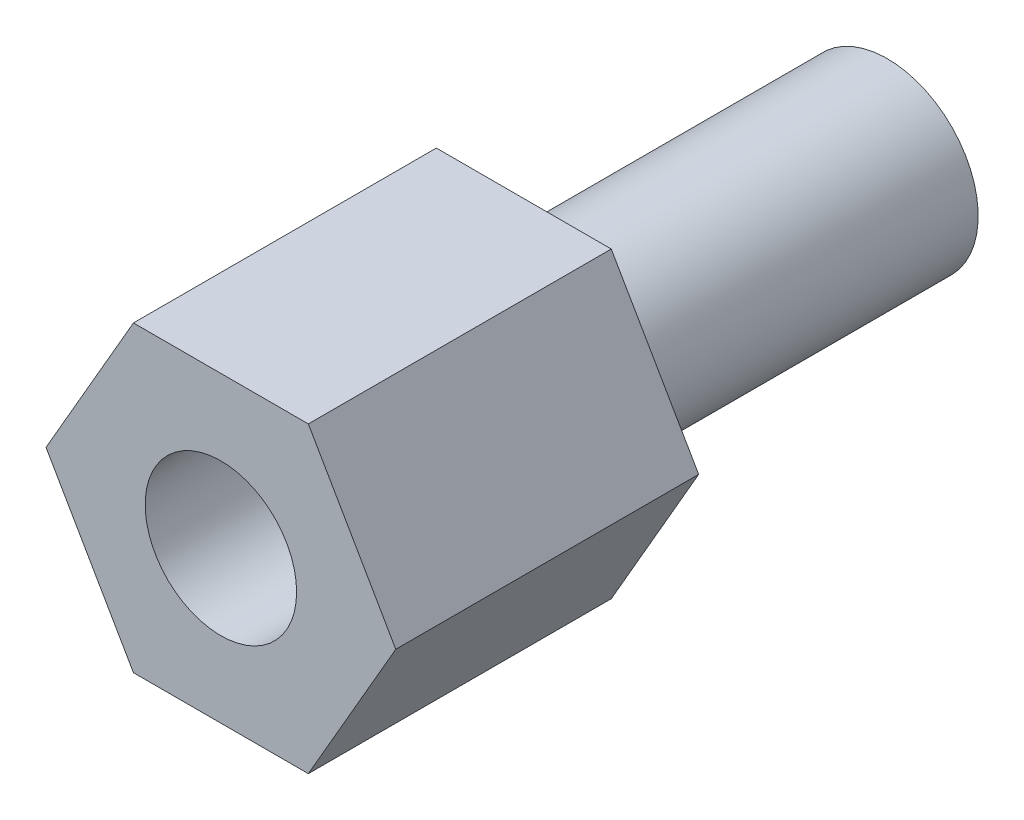
ISO-10303-21;
HEADER;
FILE_DESCRIPTION(('STEP AP214'),'2;1');
FILE_NAME('part.step','',(''),(''),'','','');
FILE_SCHEMA(('AUTOMOTIVE_DESIGN { 1 0 10303 214 1 1 1 1 }'));
ENDSEC;
DATA;
#1=APPLICATION_CONTEXT('core data for automotive mechanical design processes');
#2=APPLICATION_PROTOCOL_DEFINITION('international standard','automotive_design',2000,#1);
#3=PRODUCT_CONTEXT('',#1,'mechanical');
#4=PRODUCT('Part','Part','',(#3));
#5=PRODUCT_RELATED_PRODUCT_CATEGORY('part','',(#4));
#6=PRODUCT_DEFINITION_FORMATION('','',#4);
#7=PRODUCT_DEFINITION_CONTEXT('part definition',#1,'design');
#8=PRODUCT_DEFINITION('design','',#6,#7);
#9=PRODUCT_DEFINITION_SHAPE('','',#8);
#10=(LENGTH_UNIT() NAMED_UNIT(*) SI_UNIT(.MILLI.,.METRE.));
#11=(NAMED_UNIT(*) PLANE_ANGLE_UNIT() SI_UNIT($,.RADIAN.));
#12=(NAMED_UNIT(*) SI_UNIT($,.STERADIAN.) SOLID_ANGLE_UNIT());
#13=UNCERTAINTY_MEASURE_WITH_UNIT(LENGTH_MEASURE(1.E-05),#10,'distance_accuracy_value','');
#14=(GEOMETRIC_REPRESENTATION_CONTEXT(3) GLOBAL_UNCERTAINTY_ASSIGNED_CONTEXT((#13)) GLOBAL_UNIT_ASSIGNED_CONTEXT((#10,
#11,#12)) REPRESENTATION_CONTEXT('',''));
#15=CARTESIAN_POINT('',(0.,0.,0.));
#16=DIRECTION('',(0.,0.,1.));
#17=DIRECTION('',(1.,0.,0.));
#18=AXIS2_PLACEMENT_3D('',#15,#16,#17);
#19=CARTESIAN_POINT('',(1.44337567297406,2.5,5.));
#20=DIRECTION('',(0.,-1.,0.));
#21=DIRECTION('',(1.,0.,0.));
#22=AXIS2_PLACEMENT_3D('',#19,#20,#21);
#23=PLANE('',#22);
#24=DIRECTION('',(-1.,0.,0.));
#25=VECTOR('',#24,1.);
#26=CARTESIAN_POINT('',(1.44337567297406,2.5,0.));
#27=LINE('',#26,#25);
#28=CARTESIAN_POINT('',(1.44337567297406,2.5,0.));
#29=VERTEX_POINT('',#28);
#30=CARTESIAN_POINT('',(-1.44337567297407,2.5,0.));
#31=VERTEX_POINT('',#30);
#32=EDGE_CURVE('E123',#29,#31,#27,.T.);
#33=ORIENTED_EDGE('',*,*,#32,.T.);
#34=DIRECTION('',(0.,0.,-1.));
#35=VECTOR('',#34,1.);
#36=CARTESIAN_POINT('',(-1.44337567297407,2.5,5.));
#37=LINE('',#36,#35);
#38=CARTESIAN_POINT('',(-1.44337567297407,2.5,5.));
#39=VERTEX_POINT('',#38);
#40=EDGE_CURVE('E38',#39,#31,#37,.T.);
#41=ORIENTED_EDGE('',*,*,#40,.F.);
#42=DIRECTION('',(-1.,0.,0.));
#43=VECTOR('',#42,1.);
#44=CARTESIAN_POINT('',(1.44337567297406,2.5,5.));
#45=LINE('',#44,#43);
#46=CARTESIAN_POINT('',(1.44337567297406,2.5,5.));
#47=VERTEX_POINT('',#46);
#48=EDGE_CURVE('E134',#47,#39,#45,.T.);
#49=ORIENTED_EDGE('',*,*,#48,.F.);
#50=DIRECTION('',(0.,0.,-1.));
#51=VECTOR('',#50,1.);
#52=CARTESIAN_POINT('',(1.44337567297406,2.5,5.));
#53=LINE('',#52,#51);
#54=EDGE_CURVE('E119',#47,#29,#53,.T.);
#55=ORIENTED_EDGE('',*,*,#54,.T.);
#56=EDGE_LOOP('',(#33,#41,#49,#55));
#57=FACE_BOUND('',#56,.T.);
#58=ADVANCED_FACE('F35',(#57),#23,.F.);
#59=CARTESIAN_POINT('',(-1.44337567297407,2.5,5.));
#60=DIRECTION('',(0.866025403784439,-0.5,0.));
#61=DIRECTION('',(0.5,0.866025403784439,0.));
#62=AXIS2_PLACEMENT_3D('',#59,#60,#61);
#63=PLANE('',#62);
#64=DIRECTION('',(-0.5,-0.866025403784439,0.));
#65=VECTOR('',#64,1.);
#66=CARTESIAN_POINT('',(-1.44337567297407,2.5,0.));
#67=LINE('',#66,#65);
#68=CARTESIAN_POINT('',(-2.88675134594813,0.,0.));
#69=VERTEX_POINT('',#68);
#70=EDGE_CURVE('E126',#31,#69,#67,.T.);
#71=ORIENTED_EDGE('',*,*,#70,.T.);
#72=DIRECTION('',(0.,0.,-1.));
#73=VECTOR('',#72,1.);
#74=CARTESIAN_POINT('',(-2.88675134594813,0.,5.));
#75=LINE('',#74,#73);
#76=CARTESIAN_POINT('',(-2.88675134594813,0.,5.));
#77=VERTEX_POINT('',#76);
#78=EDGE_CURVE('E137',#77,#69,#75,.T.);
#79=ORIENTED_EDGE('',*,*,#78,.F.);
#80=DIRECTION('',(-0.5,-0.866025403784439,0.));
#81=VECTOR('',#80,1.);
#82=CARTESIAN_POINT('',(-1.44337567297407,2.5,5.));
#83=LINE('',#82,#81);
#84=EDGE_CURVE('E91',#39,#77,#83,.T.);
#85=ORIENTED_EDGE('',*,*,#84,.F.);
#86=ORIENTED_EDGE('',*,*,#40,.T.);
#87=EDGE_LOOP('',(#71,#79,#85,#86));
#88=FACE_BOUND('',#87,.T.);
#89=ADVANCED_FACE('F142',(#88),#63,.F.);
#90=CARTESIAN_POINT('',(-2.88675134594813,0.,5.));
#91=DIRECTION('',(0.866025403784438,0.5,0.));
#92=DIRECTION('',(-0.5,0.866025403784438,0.));
#93=AXIS2_PLACEMENT_3D('',#90,#91,#92);
#94=PLANE('',#93);
#95=DIRECTION('',(0.5,-0.866025403784438,0.));
#96=VECTOR('',#95,1.);
#97=CARTESIAN_POINT('',(-2.88675134594813,0.,0.));
#98=LINE('',#97,#96);
#99=CARTESIAN_POINT('',(-1.44337567297406,-2.5,0.));
#100=VERTEX_POINT('',#99);
#101=EDGE_CURVE('E129',#69,#100,#98,.T.);
#102=ORIENTED_EDGE('',*,*,#101,.T.);
#103=DIRECTION('',(0.,0.,-1.));
#104=VECTOR('',#103,1.);
#105=CARTESIAN_POINT('',(-1.44337567297406,-2.5,5.));
#106=LINE('',#105,#104);
#107=CARTESIAN_POINT('',(-1.44337567297406,-2.5,5.));
#108=VERTEX_POINT('',#107);
#109=EDGE_CURVE('E114',#108,#100,#106,.T.);
#110=ORIENTED_EDGE('',*,*,#109,.F.);
#111=DIRECTION('',(0.5,-0.866025403784438,0.));
#112=VECTOR('',#111,1.);
#113=CARTESIAN_POINT('',(-2.88675134594813,0.,5.));
#114=LINE('',#113,#112);
#115=EDGE_CURVE('E105',#77,#108,#114,.T.);
#116=ORIENTED_EDGE('',*,*,#115,.F.);
#117=ORIENTED_EDGE('',*,*,#78,.T.);
#118=EDGE_LOOP('',(#102,#110,#116,#117));
#119=FACE_BOUND('',#118,.T.);
#120=ADVANCED_FACE('F148',(#119),#94,.F.);
#121=CARTESIAN_POINT('',(-1.44337567297406,-2.5,5.));
#122=DIRECTION('',(0.,1.,0.));
#123=DIRECTION('',(-1.,0.,0.));
#124=AXIS2_PLACEMENT_3D('',#121,#122,#123);
#125=PLANE('',#124);
#126=DIRECTION('',(1.,0.,0.));
#127=VECTOR('',#126,1.);
#128=CARTESIAN_POINT('',(-1.44337567297406,-2.5,0.));
#129=LINE('',#128,#127);
#130=CARTESIAN_POINT('',(1.44337567297407,-2.5,0.));
#131=VERTEX_POINT('',#130);
#132=EDGE_CURVE('E113',#100,#131,#129,.T.);
#133=ORIENTED_EDGE('',*,*,#132,.T.);
#134=DIRECTION('',(0.,0.,-1.));
#135=VECTOR('',#134,1.);
#136=CARTESIAN_POINT('',(1.44337567297407,-2.5,5.));
#137=LINE('',#136,#135);
#138=CARTESIAN_POINT('',(1.44337567297407,-2.5,5.));
#139=VERTEX_POINT('',#138);
#140=EDGE_CURVE('E110',#139,#131,#137,.T.);
#141=ORIENTED_EDGE('',*,*,#140,.F.);
#142=DIRECTION('',(1.,0.,0.));
#143=VECTOR('',#142,1.);
#144=CARTESIAN_POINT('',(-1.44337567297406,-2.5,5.));
#145=LINE('',#144,#143);
#146=EDGE_CURVE('E99',#108,#139,#145,.T.);
#147=ORIENTED_EDGE('',*,*,#146,.F.);
#148=ORIENTED_EDGE('',*,*,#109,.T.);
#149=EDGE_LOOP('',(#133,#141,#147,#148));
#150=FACE_BOUND('',#149,.T.);
#151=ADVANCED_FACE('F111',(#150),#125,.F.);
#152=CARTESIAN_POINT('',(1.44337567297407,-2.5,5.));
#153=DIRECTION('',(-0.866025403784439,0.5,0.));
#154=DIRECTION('',(-0.5,-0.866025403784439,0.));
#155=AXIS2_PLACEMENT_3D('',#152,#153,#154);
#156=PLANE('',#155);
#157=DIRECTION('',(0.5,0.866025403784439,0.));
#158=VECTOR('',#157,1.);
#159=CARTESIAN_POINT('',(1.44337567297407,-2.5,0.));
#160=LINE('',#159,#158);
#161=CARTESIAN_POINT('',(2.88675134594813,0.,0.));
#162=VERTEX_POINT('',#161);
#163=EDGE_CURVE('E76',#131,#162,#160,.T.);
#164=ORIENTED_EDGE('',*,*,#163,.T.);
#165=DIRECTION('',(0.,0.,-1.));
#166=VECTOR('',#165,1.);
#167=CARTESIAN_POINT('',(2.88675134594813,0.,5.));
#168=LINE('',#167,#166);
#169=CARTESIAN_POINT('',(2.88675134594813,0.,5.));
#170=VERTEX_POINT('',#169);
#171=EDGE_CURVE('E115',#170,#162,#168,.T.);
#172=ORIENTED_EDGE('',*,*,#171,.F.);
#173=DIRECTION('',(0.5,0.866025403784439,0.));
#174=VECTOR('',#173,1.);
#175=CARTESIAN_POINT('',(1.44337567297407,-2.5,5.));
#176=LINE('',#175,#174);
#177=EDGE_CURVE('E103',#139,#170,#176,.T.);
#178=ORIENTED_EDGE('',*,*,#177,.F.);
#179=ORIENTED_EDGE('',*,*,#140,.T.);
#180=EDGE_LOOP('',(#164,#172,#178,#179));
#181=FACE_BOUND('',#180,.T.);
#182=ADVANCED_FACE('F117',(#181),#156,.F.);
#183=CARTESIAN_POINT('',(2.88675134594813,0.,5.));
#184=DIRECTION('',(-0.866025403784439,-0.5,0.));
#185=DIRECTION('',(0.5,-0.866025403784439,0.));
#186=AXIS2_PLACEMENT_3D('',#183,#184,#185);
#187=PLANE('',#186);
#188=DIRECTION('',(-0.5,0.866025403784439,0.));
#189=VECTOR('',#188,1.);
#190=CARTESIAN_POINT('',(2.88675134594813,0.,0.));
#191=LINE('',#190,#189);
#192=EDGE_CURVE('E82',#162,#29,#191,.T.);
#193=ORIENTED_EDGE('',*,*,#192,.T.);
#194=ORIENTED_EDGE('',*,*,#54,.F.);
#195=DIRECTION('',(-0.5,0.866025403784439,0.));
#196=VECTOR('',#195,1.);
#197=CARTESIAN_POINT('',(2.88675134594813,0.,5.));
#198=LINE('',#197,#196);
#199=EDGE_CURVE('E52',#170,#47,#198,.T.);
#200=ORIENTED_EDGE('',*,*,#199,.F.);
#201=ORIENTED_EDGE('',*,*,#171,.T.);
#202=EDGE_LOOP('',(#193,#194,#200,#201));
#203=FACE_BOUND('',#202,.T.);
#204=ADVANCED_FACE('F164',(#203),#187,.F.);
#205=CARTESIAN_POINT('',(0.,0.,5.));
#206=DIRECTION('',(0.,0.,1.));
#207=DIRECTION('',(1.,0.,0.));
#208=AXIS2_PLACEMENT_3D('',#205,#206,#207);
#209=PLANE('',#208);
#210=CARTESIAN_POINT('',(0.,0.,5.));
#211=DIRECTION('',(0.,0.,1.));
#212=DIRECTION('',(1.,0.,0.));
#213=AXIS2_PLACEMENT_3D('',#210,#211,#212);
#214=CIRCLE('',#213,1.24999999999999);
#215=CARTESIAN_POINT('',(1.24999999999999,0.,5.));
#216=VERTEX_POINT('',#215);
#217=EDGE_CURVE('E157',#216,#216,#214,.T.);
#218=ORIENTED_EDGE('',*,*,#217,.F.);
#219=EDGE_LOOP('',(#218));
#220=FACE_BOUND('',#219,.T.);
#221=ORIENTED_EDGE('',*,*,#48,.T.);
#222=ORIENTED_EDGE('',*,*,#84,.T.);
#223=ORIENTED_EDGE('',*,*,#115,.T.);
#224=ORIENTED_EDGE('',*,*,#146,.T.);
#225=ORIENTED_EDGE('',*,*,#177,.T.);
#226=ORIENTED_EDGE('',*,*,#199,.T.);
#227=EDGE_LOOP('',(#221,#222,#223,#224,#225,#226));
#228=FACE_BOUND('',#227,.T.);
#229=ADVANCED_FACE('F101',(#220,#228),#209,.T.);
#230=CARTESIAN_POINT('',(0.,0.,0.));
#231=DIRECTION('',(0.,0.,1.));
#232=DIRECTION('',(1.,0.,0.));
#233=AXIS2_PLACEMENT_3D('',#230,#231,#232);
#234=PLANE('',#233);
#235=CARTESIAN_POINT('',(0.,0.,0.));
#236=DIRECTION('',(0.,0.,-1.));
#237=DIRECTION('',(-1.,0.,0.));
#238=AXIS2_PLACEMENT_3D('',#235,#236,#237);
#239=CIRCLE('',#238,1.5);
#240=CARTESIAN_POINT('',(-1.5,0.,0.));
#241=VERTEX_POINT('',#240);
#242=EDGE_CURVE('E11',#241,#241,#239,.T.);
#243=ORIENTED_EDGE('',*,*,#242,.F.);
#244=EDGE_LOOP('',(#243));
#245=FACE_BOUND('',#244,.T.);
#246=ORIENTED_EDGE('',*,*,#32,.F.);
#247=ORIENTED_EDGE('',*,*,#192,.F.);
#248=ORIENTED_EDGE('',*,*,#163,.F.);
#249=ORIENTED_EDGE('',*,*,#132,.F.);
#250=ORIENTED_EDGE('',*,*,#101,.F.);
#251=ORIENTED_EDGE('',*,*,#70,.F.);
#252=EDGE_LOOP('',(#246,#247,#248,#249,#250,#251));
#253=FACE_BOUND('',#252,.T.);
#254=ADVANCED_FACE('F147',(#245,#253),#234,.F.);
#255=CARTESIAN_POINT('',(0.,0.,-6.));
#256=DIRECTION('',(0.,0.,1.));
#257=DIRECTION('',(1.,0.,0.));
#258=AXIS2_PLACEMENT_3D('',#255,#256,#257);
#259=CYLINDRICAL_SURFACE('',#258,1.5);
#260=CARTESIAN_POINT('',(0.,0.,-6.));
#261=DIRECTION('',(0.,0.,-1.));
#262=DIRECTION('',(-1.,0.,0.));
#263=AXIS2_PLACEMENT_3D('',#260,#261,#262);
#264=CIRCLE('',#263,1.5);
#265=CARTESIAN_POINT('',(-1.5,0.,-6.));
#266=VERTEX_POINT('',#265);
#267=EDGE_CURVE('E127',#266,#266,#264,.T.);
#268=ORIENTED_EDGE('',*,*,#267,.F.);
#269=EDGE_LOOP('',(#268));
#270=FACE_BOUND('',#269,.T.);
#271=ORIENTED_EDGE('',*,*,#242,.T.);
#272=EDGE_LOOP('',(#271));
#273=FACE_BOUND('',#272,.T.);
#274=ADVANCED_FACE('F170',(#270,#273),#259,.T.);
#275=CARTESIAN_POINT('',(0.,0.,-6.));
#276=DIRECTION('',(0.,0.,-1.));
#277=DIRECTION('',(-1.,0.,0.));
#278=AXIS2_PLACEMENT_3D('',#275,#276,#277);
#279=PLANE('',#278);
#280=ORIENTED_EDGE('',*,*,#267,.T.);
#281=EDGE_LOOP('',(#280));
#282=FACE_BOUND('',#281,.T.);
#283=ADVANCED_FACE('F211',(#282),#279,.T.);
#284=CARTESIAN_POINT('',(0.,0.,-2.5));
#285=DIRECTION('',(0.,0.,1.));
#286=DIRECTION('',(1.,0.,0.));
#287=AXIS2_PLACEMENT_3D('',#284,#285,#286);
#288=CONICAL_SURFACE('',#287,1.25,1.02974425867665);
#289=CARTESIAN_POINT('',(0.,0.,-3.25107577378445));
#290=VERTEX_POINT('',#289);
#291=VERTEX_LOOP('',#290);
#292=FACE_BOUND('',#291,.T.);
#293=CARTESIAN_POINT('',(0.,0.,-2.5));
#294=DIRECTION('',(0.,0.,1.));
#295=DIRECTION('',(1.,0.,0.));
#296=AXIS2_PLACEMENT_3D('',#293,#294,#295);
#297=CIRCLE('',#296,1.25);
#298=CARTESIAN_POINT('',(1.25,0.,-2.5));
#299=VERTEX_POINT('',#298);
#300=EDGE_CURVE('E154',#299,#299,#297,.T.);
#301=ORIENTED_EDGE('',*,*,#300,.T.);
#302=EDGE_LOOP('',(#301));
#303=FACE_BOUND('',#302,.T.);
#304=ADVANCED_FACE('F219',(#292,#303),#288,.F.);
#305=CARTESIAN_POINT('',(0.,0.,5.));
#306=DIRECTION('',(0.,0.,1.));
#307=DIRECTION('',(1.,0.,0.));
#308=AXIS2_PLACEMENT_3D('',#305,#306,#307);
#309=CYLINDRICAL_SURFACE('',#308,1.24999999999999);
#310=ORIENTED_EDGE('',*,*,#300,.F.);
#311=EDGE_LOOP('',(#310));
#312=FACE_BOUND('',#311,.T.);
#313=ORIENTED_EDGE('',*,*,#217,.T.);
#314=EDGE_LOOP('',(#313));
#315=FACE_BOUND('',#314,.T.);
#316=ADVANCED_FACE('F161',(#312,#315),#309,.F.);
#317=CLOSED_SHELL('',(#58,#89,#120,#151,#182,#204,#229,#254,#274,#283,#304,#316));
#318=MANIFOLD_SOLID_BREP('B2',#317);
#319=ADVANCED_BREP_SHAPE_REPRESENTATION('',(#18,#318),#14);
#320=SHAPE_DEFINITION_REPRESENTATION(#9,#319);
ENDSEC;
END-ISO-10303-21;
